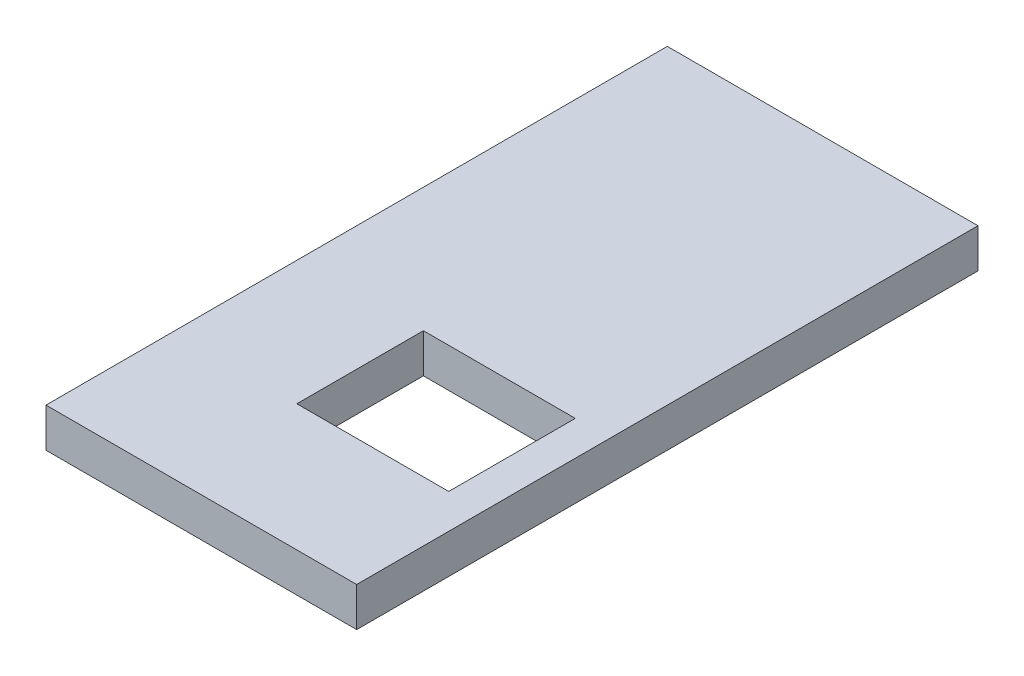
ISO-10303-21;
HEADER;
FILE_DESCRIPTION(('STEP AP214'),'2;1');
FILE_NAME('part.step','',(''),(''),'','','');
FILE_SCHEMA(('AUTOMOTIVE_DESIGN { 1 0 10303 214 1 1 1 1 }'));
ENDSEC;
DATA;
#1=APPLICATION_CONTEXT('core data for automotive mechanical design processes');
#2=APPLICATION_PROTOCOL_DEFINITION('international standard','automotive_design',2000,#1);
#3=PRODUCT_CONTEXT('',#1,'mechanical');
#4=PRODUCT('Part','Part','',(#3));
#5=PRODUCT_RELATED_PRODUCT_CATEGORY('part','',(#4));
#6=PRODUCT_DEFINITION_FORMATION('','',#4);
#7=PRODUCT_DEFINITION_CONTEXT('part definition',#1,'design');
#8=PRODUCT_DEFINITION('design','',#6,#7);
#9=PRODUCT_DEFINITION_SHAPE('','',#8);
#10=(LENGTH_UNIT() NAMED_UNIT(*) SI_UNIT(.MILLI.,.METRE.));
#11=(NAMED_UNIT(*) PLANE_ANGLE_UNIT() SI_UNIT($,.RADIAN.));
#12=(NAMED_UNIT(*) SI_UNIT($,.STERADIAN.) SOLID_ANGLE_UNIT());
#13=UNCERTAINTY_MEASURE_WITH_UNIT(LENGTH_MEASURE(1.E-05),#10,'distance_accuracy_value','');
#14=(GEOMETRIC_REPRESENTATION_CONTEXT(3) GLOBAL_UNCERTAINTY_ASSIGNED_CONTEXT((#13)) GLOBAL_UNIT_ASSIGNED_CONTEXT((#10,
#11,#12)) REPRESENTATION_CONTEXT('',''));
#15=CARTESIAN_POINT('',(0.,0.,0.));
#16=DIRECTION('',(0.,0.,1.));
#17=DIRECTION('',(1.,0.,0.));
#18=AXIS2_PLACEMENT_3D('',#15,#16,#17);
#19=CARTESIAN_POINT('',(0.,0.,2700.));
#20=DIRECTION('',(1.,0.,0.));
#21=DIRECTION('',(0.,0.,-1.));
#22=AXIS2_PLACEMENT_3D('',#19,#20,#21);
#23=PLANE('',#22);
#24=DIRECTION('',(0.,-1.,0.));
#25=VECTOR('',#24,1.);
#26=CARTESIAN_POINT('',(0.,0.,0.));
#27=LINE('',#26,#25);
#28=CARTESIAN_POINT('',(0.,170.,0.));
#29=VERTEX_POINT('',#28);
#30=CARTESIAN_POINT('',(0.,0.,0.));
#31=VERTEX_POINT('',#30);
#32=EDGE_CURVE('E146',#29,#31,#27,.T.);
#33=ORIENTED_EDGE('',*,*,#32,.T.);
#34=DIRECTION('',(0.,0.,-1.));
#35=VECTOR('',#34,1.);
#36=CARTESIAN_POINT('',(0.,0.,2700.));
#37=LINE('',#36,#35);
#38=CARTESIAN_POINT('',(0.,0.,2700.));
#39=VERTEX_POINT('',#38);
#40=EDGE_CURVE('E11',#39,#31,#37,.T.);
#41=ORIENTED_EDGE('',*,*,#40,.F.);
#42=DIRECTION('',(0.,-1.,0.));
#43=VECTOR('',#42,1.);
#44=CARTESIAN_POINT('',(0.,0.,2700.));
#45=LINE('',#44,#43);
#46=CARTESIAN_POINT('',(0.,170.,2700.));
#47=VERTEX_POINT('',#46);
#48=EDGE_CURVE('E152',#47,#39,#45,.T.);
#49=ORIENTED_EDGE('',*,*,#48,.F.);
#50=DIRECTION('',(0.,0.,-1.));
#51=VECTOR('',#50,1.);
#52=CARTESIAN_POINT('',(0.,170.,2700.));
#53=LINE('',#52,#51);
#54=EDGE_CURVE('E166',#47,#29,#53,.T.);
#55=ORIENTED_EDGE('',*,*,#54,.T.);
#56=EDGE_LOOP('',(#33,#41,#49,#55));
#57=FACE_BOUND('',#56,.T.);
#58=ADVANCED_FACE('F38',(#57),#23,.F.);
#59=CARTESIAN_POINT('',(0.,0.,2700.));
#60=DIRECTION('',(0.,1.,0.));
#61=DIRECTION('',(0.,0.,1.));
#62=AXIS2_PLACEMENT_3D('',#59,#60,#61);
#63=PLANE('',#62);
#64=DIRECTION('',(-1.,0.,0.));
#65=VECTOR('',#64,1.);
#66=CARTESIAN_POINT('',(540.,0.,1600.));
#67=LINE('',#66,#65);
#68=CARTESIAN_POINT('',(1200.,0.,1600.));
#69=VERTEX_POINT('',#68);
#70=CARTESIAN_POINT('',(540.,0.,1600.));
#71=VERTEX_POINT('',#70);
#72=EDGE_CURVE('E112',#69,#71,#67,.T.);
#73=ORIENTED_EDGE('',*,*,#72,.T.);
#74=DIRECTION('',(0.,0.,1.));
#75=VECTOR('',#74,1.);
#76=CARTESIAN_POINT('',(540.,0.,1600.));
#77=LINE('',#76,#75);
#78=CARTESIAN_POINT('',(540.,0.,2150.));
#79=VERTEX_POINT('',#78);
#80=EDGE_CURVE('E105',#71,#79,#77,.T.);
#81=ORIENTED_EDGE('',*,*,#80,.T.);
#82=DIRECTION('',(1.,0.,0.));
#83=VECTOR('',#82,1.);
#84=CARTESIAN_POINT('',(540.,0.,2150.));
#85=LINE('',#84,#83);
#86=CARTESIAN_POINT('',(1200.,0.,2150.));
#87=VERTEX_POINT('',#86);
#88=EDGE_CURVE('E115',#79,#87,#85,.T.);
#89=ORIENTED_EDGE('',*,*,#88,.T.);
#90=DIRECTION('',(0.,0.,-1.));
#91=VECTOR('',#90,1.);
#92=CARTESIAN_POINT('',(1200.,0.,1600.));
#93=LINE('',#92,#91);
#94=EDGE_CURVE('E53',#87,#69,#93,.T.);
#95=ORIENTED_EDGE('',*,*,#94,.T.);
#96=EDGE_LOOP('',(#73,#81,#89,#95));
#97=FACE_BOUND('',#96,.T.);
#98=DIRECTION('',(1.,0.,0.));
#99=VECTOR('',#98,1.);
#100=CARTESIAN_POINT('',(0.,0.,0.));
#101=LINE('',#100,#99);
#102=CARTESIAN_POINT('',(1350.,0.,0.));
#103=VERTEX_POINT('',#102);
#104=EDGE_CURVE('E170',#31,#103,#101,.T.);
#105=ORIENTED_EDGE('',*,*,#104,.T.);
#106=DIRECTION('',(0.,0.,-1.));
#107=VECTOR('',#106,1.);
#108=CARTESIAN_POINT('',(1350.,0.,2700.));
#109=LINE('',#108,#107);
#110=CARTESIAN_POINT('',(1350.,0.,2700.));
#111=VERTEX_POINT('',#110);
#112=EDGE_CURVE('E46',#111,#103,#109,.T.);
#113=ORIENTED_EDGE('',*,*,#112,.F.);
#114=DIRECTION('',(1.,0.,0.));
#115=VECTOR('',#114,1.);
#116=CARTESIAN_POINT('',(0.,0.,2700.));
#117=LINE('',#116,#115);
#118=EDGE_CURVE('E156',#39,#111,#117,.T.);
#119=ORIENTED_EDGE('',*,*,#118,.F.);
#120=ORIENTED_EDGE('',*,*,#40,.T.);
#121=EDGE_LOOP('',(#105,#113,#119,#120));
#122=FACE_BOUND('',#121,.T.);
#123=ADVANCED_FACE('F120',(#97,#122),#63,.F.);
#124=CARTESIAN_POINT('',(1350.,0.,2700.));
#125=DIRECTION('',(-1.,0.,0.));
#126=DIRECTION('',(0.,0.,1.));
#127=AXIS2_PLACEMENT_3D('',#124,#125,#126);
#128=PLANE('',#127);
#129=DIRECTION('',(0.,1.,0.));
#130=VECTOR('',#129,1.);
#131=CARTESIAN_POINT('',(1350.,0.,0.));
#132=LINE('',#131,#130);
#133=CARTESIAN_POINT('',(1350.,170.,0.));
#134=VERTEX_POINT('',#133);
#135=EDGE_CURVE('E173',#103,#134,#132,.T.);
#136=ORIENTED_EDGE('',*,*,#135,.T.);
#137=DIRECTION('',(0.,0.,-1.));
#138=VECTOR('',#137,1.);
#139=CARTESIAN_POINT('',(1350.,170.,2700.));
#140=LINE('',#139,#138);
#141=CARTESIAN_POINT('',(1350.,170.,2700.));
#142=VERTEX_POINT('',#141);
#143=EDGE_CURVE('E181',#142,#134,#140,.T.);
#144=ORIENTED_EDGE('',*,*,#143,.F.);
#145=DIRECTION('',(0.,1.,0.));
#146=VECTOR('',#145,1.);
#147=CARTESIAN_POINT('',(1350.,0.,2700.));
#148=LINE('',#147,#146);
#149=EDGE_CURVE('E160',#111,#142,#148,.T.);
#150=ORIENTED_EDGE('',*,*,#149,.F.);
#151=ORIENTED_EDGE('',*,*,#112,.T.);
#152=EDGE_LOOP('',(#136,#144,#150,#151));
#153=FACE_BOUND('',#152,.T.);
#154=ADVANCED_FACE('F190',(#153),#128,.F.);
#155=CARTESIAN_POINT('',(0.,170.,2700.));
#156=DIRECTION('',(0.,-1.,0.));
#157=DIRECTION('',(0.,0.,-1.));
#158=AXIS2_PLACEMENT_3D('',#155,#156,#157);
#159=PLANE('',#158);
#160=DIRECTION('',(1.,0.,0.));
#161=VECTOR('',#160,1.);
#162=CARTESIAN_POINT('',(540.,170.,2150.));
#163=LINE('',#162,#161);
#164=CARTESIAN_POINT('',(540.,170.,2150.));
#165=VERTEX_POINT('',#164);
#166=CARTESIAN_POINT('',(1200.,170.,2150.));
#167=VERTEX_POINT('',#166);
#168=EDGE_CURVE('E137',#165,#167,#163,.T.);
#169=ORIENTED_EDGE('',*,*,#168,.F.);
#170=DIRECTION('',(0.,0.,1.));
#171=VECTOR('',#170,1.);
#172=CARTESIAN_POINT('',(540.,170.,1600.));
#173=LINE('',#172,#171);
#174=CARTESIAN_POINT('',(540.,170.,1600.));
#175=VERTEX_POINT('',#174);
#176=EDGE_CURVE('E61',#175,#165,#173,.T.);
#177=ORIENTED_EDGE('',*,*,#176,.F.);
#178=DIRECTION('',(-1.,0.,0.));
#179=VECTOR('',#178,1.);
#180=CARTESIAN_POINT('',(540.,170.,1600.));
#181=LINE('',#180,#179);
#182=CARTESIAN_POINT('',(1200.,170.,1600.));
#183=VERTEX_POINT('',#182);
#184=EDGE_CURVE('E124',#183,#175,#181,.T.);
#185=ORIENTED_EDGE('',*,*,#184,.F.);
#186=DIRECTION('',(0.,0.,-1.));
#187=VECTOR('',#186,1.);
#188=CARTESIAN_POINT('',(1200.,170.,1600.));
#189=LINE('',#188,#187);
#190=EDGE_CURVE('E128',#167,#183,#189,.T.);
#191=ORIENTED_EDGE('',*,*,#190,.F.);
#192=EDGE_LOOP('',(#169,#177,#185,#191));
#193=FACE_BOUND('',#192,.T.);
#194=DIRECTION('',(-1.,0.,0.));
#195=VECTOR('',#194,1.);
#196=CARTESIAN_POINT('',(0.,170.,0.));
#197=LINE('',#196,#195);
#198=EDGE_CURVE('E157',#134,#29,#197,.T.);
#199=ORIENTED_EDGE('',*,*,#198,.T.);
#200=ORIENTED_EDGE('',*,*,#54,.F.);
#201=DIRECTION('',(-1.,0.,0.));
#202=VECTOR('',#201,1.);
#203=CARTESIAN_POINT('',(0.,170.,2700.));
#204=LINE('',#203,#202);
#205=EDGE_CURVE('E163',#142,#47,#204,.T.);
#206=ORIENTED_EDGE('',*,*,#205,.F.);
#207=ORIENTED_EDGE('',*,*,#143,.T.);
#208=EDGE_LOOP('',(#199,#200,#206,#207));
#209=FACE_BOUND('',#208,.T.);
#210=ADVANCED_FACE('F198',(#193,#209),#159,.F.);
#211=CARTESIAN_POINT('',(0.,0.,2700.));
#212=DIRECTION('',(0.,0.,-1.));
#213=DIRECTION('',(-1.,0.,0.));
#214=AXIS2_PLACEMENT_3D('',#211,#212,#213);
#215=PLANE('',#214);
#216=ORIENTED_EDGE('',*,*,#48,.T.);
#217=ORIENTED_EDGE('',*,*,#118,.T.);
#218=ORIENTED_EDGE('',*,*,#149,.T.);
#219=ORIENTED_EDGE('',*,*,#205,.T.);
#220=EDGE_LOOP('',(#216,#217,#218,#219));
#221=FACE_BOUND('',#220,.T.);
#222=ADVANCED_FACE('F204',(#221),#215,.F.);
#223=CARTESIAN_POINT('',(0.,0.,0.));
#224=DIRECTION('',(0.,0.,-1.));
#225=DIRECTION('',(-1.,0.,0.));
#226=AXIS2_PLACEMENT_3D('',#223,#224,#225);
#227=PLANE('',#226);
#228=ORIENTED_EDGE('',*,*,#32,.F.);
#229=ORIENTED_EDGE('',*,*,#198,.F.);
#230=ORIENTED_EDGE('',*,*,#135,.F.);
#231=ORIENTED_EDGE('',*,*,#104,.F.);
#232=EDGE_LOOP('',(#228,#229,#230,#231));
#233=FACE_BOUND('',#232,.T.);
#234=ADVANCED_FACE('F195',(#233),#227,.T.);
#235=CARTESIAN_POINT('',(540.,0.,1600.));
#236=DIRECTION('',(-1.,0.,0.));
#237=DIRECTION('',(0.,0.,1.));
#238=AXIS2_PLACEMENT_3D('',#235,#236,#237);
#239=PLANE('',#238);
#240=ORIENTED_EDGE('',*,*,#176,.T.);
#241=DIRECTION('',(0.,1.,0.));
#242=VECTOR('',#241,1.);
#243=CARTESIAN_POINT('',(540.,0.,2150.));
#244=LINE('',#243,#242);
#245=EDGE_CURVE('E101',#79,#165,#244,.T.);
#246=ORIENTED_EDGE('',*,*,#245,.F.);
#247=ORIENTED_EDGE('',*,*,#80,.F.);
#248=DIRECTION('',(0.,1.,0.));
#249=VECTOR('',#248,1.);
#250=CARTESIAN_POINT('',(540.,0.,1600.));
#251=LINE('',#250,#249);
#252=EDGE_CURVE('E143',#71,#175,#251,.T.);
#253=ORIENTED_EDGE('',*,*,#252,.T.);
#254=EDGE_LOOP('',(#240,#246,#247,#253));
#255=FACE_BOUND('',#254,.T.);
#256=ADVANCED_FACE('F103',(#255),#239,.F.);
#257=CARTESIAN_POINT('',(540.,0.,1600.));
#258=DIRECTION('',(0.,0.,-1.));
#259=DIRECTION('',(-1.,0.,0.));
#260=AXIS2_PLACEMENT_3D('',#257,#258,#259);
#261=PLANE('',#260);
#262=ORIENTED_EDGE('',*,*,#184,.T.);
#263=ORIENTED_EDGE('',*,*,#252,.F.);
#264=ORIENTED_EDGE('',*,*,#72,.F.);
#265=DIRECTION('',(0.,1.,0.));
#266=VECTOR('',#265,1.);
#267=CARTESIAN_POINT('',(1200.,0.,1600.));
#268=LINE('',#267,#266);
#269=EDGE_CURVE('E147',#69,#183,#268,.T.);
#270=ORIENTED_EDGE('',*,*,#269,.T.);
#271=EDGE_LOOP('',(#262,#263,#264,#270));
#272=FACE_BOUND('',#271,.T.);
#273=ADVANCED_FACE('F222',(#272),#261,.F.);
#274=CARTESIAN_POINT('',(1200.,0.,1600.));
#275=DIRECTION('',(1.,0.,0.));
#276=DIRECTION('',(0.,0.,-1.));
#277=AXIS2_PLACEMENT_3D('',#274,#275,#276);
#278=PLANE('',#277);
#279=ORIENTED_EDGE('',*,*,#190,.T.);
#280=ORIENTED_EDGE('',*,*,#269,.F.);
#281=ORIENTED_EDGE('',*,*,#94,.F.);
#282=DIRECTION('',(0.,1.,0.));
#283=VECTOR('',#282,1.);
#284=CARTESIAN_POINT('',(1200.,0.,2150.));
#285=LINE('',#284,#283);
#286=EDGE_CURVE('E111',#87,#167,#285,.T.);
#287=ORIENTED_EDGE('',*,*,#286,.T.);
#288=EDGE_LOOP('',(#279,#280,#281,#287));
#289=FACE_BOUND('',#288,.T.);
#290=ADVANCED_FACE('F225',(#289),#278,.F.);
#291=CARTESIAN_POINT('',(540.,0.,2150.));
#292=DIRECTION('',(0.,0.,1.));
#293=DIRECTION('',(1.,0.,0.));
#294=AXIS2_PLACEMENT_3D('',#291,#292,#293);
#295=PLANE('',#294);
#296=ORIENTED_EDGE('',*,*,#168,.T.);
#297=ORIENTED_EDGE('',*,*,#286,.F.);
#298=ORIENTED_EDGE('',*,*,#88,.F.);
#299=ORIENTED_EDGE('',*,*,#245,.T.);
#300=EDGE_LOOP('',(#296,#297,#298,#299));
#301=FACE_BOUND('',#300,.T.);
#302=ADVANCED_FACE('F116',(#301),#295,.F.);
#303=CLOSED_SHELL('',(#58,#123,#154,#210,#222,#234,#256,#273,#290,#302));
#304=MANIFOLD_SOLID_BREP('B2',#303);
#305=ADVANCED_BREP_SHAPE_REPRESENTATION('',(#18,#304),#14);
#306=SHAPE_DEFINITION_REPRESENTATION(#9,#305);
ENDSEC;
END-ISO-10303-21;
